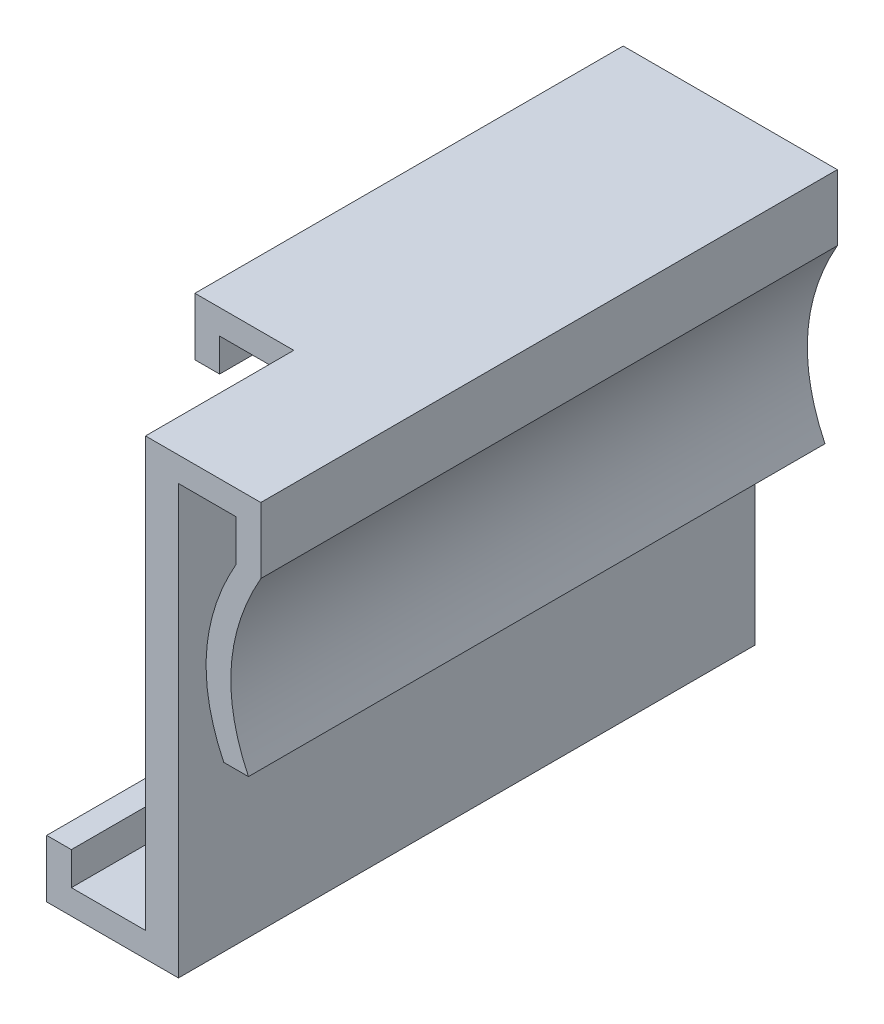
ISO-10303-21;
HEADER;
FILE_DESCRIPTION(('STEP AP214'),'2;1');
FILE_NAME('part.step','',(''),(''),'','','');
FILE_SCHEMA(('AUTOMOTIVE_DESIGN { 1 0 10303 214 1 1 1 1 }'));
ENDSEC;
DATA;
#1=APPLICATION_CONTEXT('core data for automotive mechanical design processes');
#2=APPLICATION_PROTOCOL_DEFINITION('international standard','automotive_design',2000,#1);
#3=PRODUCT_CONTEXT('',#1,'mechanical');
#4=PRODUCT('Part','Part','',(#3));
#5=PRODUCT_RELATED_PRODUCT_CATEGORY('part','',(#4));
#6=PRODUCT_DEFINITION_FORMATION('','',#4);
#7=PRODUCT_DEFINITION_CONTEXT('part definition',#1,'design');
#8=PRODUCT_DEFINITION('design','',#6,#7);
#9=PRODUCT_DEFINITION_SHAPE('','',#8);
#10=(LENGTH_UNIT() NAMED_UNIT(*) SI_UNIT(.MILLI.,.METRE.));
#11=(NAMED_UNIT(*) PLANE_ANGLE_UNIT() SI_UNIT($,.RADIAN.));
#12=(NAMED_UNIT(*) SI_UNIT($,.STERADIAN.) SOLID_ANGLE_UNIT());
#13=UNCERTAINTY_MEASURE_WITH_UNIT(LENGTH_MEASURE(1.E-05),#10,'distance_accuracy_value','');
#14=(GEOMETRIC_REPRESENTATION_CONTEXT(3) GLOBAL_UNCERTAINTY_ASSIGNED_CONTEXT((#13)) GLOBAL_UNIT_ASSIGNED_CONTEXT((#10,
#11,#12)) REPRESENTATION_CONTEXT('',''));
#15=CARTESIAN_POINT('',(0.,0.,0.));
#16=DIRECTION('',(0.,0.,1.));
#17=DIRECTION('',(1.,0.,0.));
#18=AXIS2_PLACEMENT_3D('',#15,#16,#17);
#19=CARTESIAN_POINT('',(-7.,0.,35.));
#20=DIRECTION('',(1.,0.,0.));
#21=DIRECTION('',(0.,0.,-1.));
#22=AXIS2_PLACEMENT_3D('',#19,#20,#21);
#23=PLANE('',#22);
#24=DIRECTION('',(0.,-1.,0.));
#25=VECTOR('',#24,1.);
#26=CARTESIAN_POINT('',(-7.,13.75,26.));
#27=LINE('',#26,#25);
#28=CARTESIAN_POINT('',(-7.,13.75,26.));
#29=VERTEX_POINT('',#28);
#30=CARTESIAN_POINT('',(-7.,10.25,26.));
#31=VERTEX_POINT('',#30);
#32=EDGE_CURVE('E251',#29,#31,#27,.T.);
#33=ORIENTED_EDGE('',*,*,#32,.F.);
#34=DIRECTION('',(0.,0.,-1.));
#35=VECTOR('',#34,1.);
#36=CARTESIAN_POINT('',(-7.,13.75,35.));
#37=LINE('',#36,#35);
#38=CARTESIAN_POINT('',(-7.,13.75,0.));
#39=VERTEX_POINT('',#38);
#40=EDGE_CURVE('E280',#29,#39,#37,.T.);
#41=ORIENTED_EDGE('',*,*,#40,.T.);
#42=DIRECTION('',(0.,-1.,0.));
#43=VECTOR('',#42,1.);
#44=CARTESIAN_POINT('',(-7.,0.,0.));
#45=LINE('',#44,#43);
#46=CARTESIAN_POINT('',(-7.,10.25,0.));
#47=VERTEX_POINT('',#46);
#48=EDGE_CURVE('E356',#39,#47,#45,.T.);
#49=ORIENTED_EDGE('',*,*,#48,.T.);
#50=DIRECTION('',(0.,0.,-1.));
#51=VECTOR('',#50,1.);
#52=CARTESIAN_POINT('',(-7.,10.25,35.));
#53=LINE('',#52,#51);
#54=EDGE_CURVE('E278',#31,#47,#53,.T.);
#55=ORIENTED_EDGE('',*,*,#54,.F.);
#56=EDGE_LOOP('',(#33,#41,#49,#55));
#57=FACE_BOUND('',#56,.T.);
#58=ADVANCED_FACE('F37',(#57),#23,.F.);
#59=CARTESIAN_POINT('',(0.,10.25,35.));
#60=DIRECTION('',(0.,1.,0.));
#61=DIRECTION('',(0.,0.,1.));
#62=AXIS2_PLACEMENT_3D('',#59,#60,#61);
#63=PLANE('',#62);
#64=DIRECTION('',(1.,0.,0.));
#65=VECTOR('',#64,1.);
#66=CARTESIAN_POINT('',(-7.,10.25,26.));
#67=LINE('',#66,#65);
#68=CARTESIAN_POINT('',(-5.5,10.25,26.));
#69=VERTEX_POINT('',#68);
#70=EDGE_CURVE('E248',#31,#69,#67,.T.);
#71=ORIENTED_EDGE('',*,*,#70,.F.);
#72=ORIENTED_EDGE('',*,*,#54,.T.);
#73=DIRECTION('',(1.,0.,0.));
#74=VECTOR('',#73,1.);
#75=CARTESIAN_POINT('',(0.,10.25,0.));
#76=LINE('',#75,#74);
#77=CARTESIAN_POINT('',(-5.5,10.25,0.));
#78=VERTEX_POINT('',#77);
#79=EDGE_CURVE('E359',#47,#78,#76,.T.);
#80=ORIENTED_EDGE('',*,*,#79,.T.);
#81=DIRECTION('',(0.,0.,-1.));
#82=VECTOR('',#81,1.);
#83=CARTESIAN_POINT('',(-5.5,10.25,35.));
#84=LINE('',#83,#82);
#85=EDGE_CURVE('E272',#69,#78,#84,.T.);
#86=ORIENTED_EDGE('',*,*,#85,.F.);
#87=EDGE_LOOP('',(#71,#72,#80,#86));
#88=FACE_BOUND('',#87,.T.);
#89=ADVANCED_FACE('F373',(#88),#63,.F.);
#90=CARTESIAN_POINT('',(-5.5,0.,35.));
#91=DIRECTION('',(1.,0.,0.));
#92=DIRECTION('',(0.,1.,0.));
#93=AXIS2_PLACEMENT_3D('',#90,#91,#92);
#94=PLANE('',#93);
#95=DIRECTION('',(0.,0.,-1.));
#96=VECTOR('',#95,1.);
#97=CARTESIAN_POINT('',(-5.5,12.25,35.));
#98=LINE('',#97,#96);
#99=CARTESIAN_POINT('',(-5.5,12.25,26.));
#100=VERTEX_POINT('',#99);
#101=CARTESIAN_POINT('',(-5.5,12.25,0.));
#102=VERTEX_POINT('',#101);
#103=EDGE_CURVE('E113',#100,#102,#98,.T.);
#104=ORIENTED_EDGE('',*,*,#103,.F.);
#105=DIRECTION('',(0.,1.,0.));
#106=VECTOR('',#105,1.);
#107=CARTESIAN_POINT('',(-5.5,10.25,26.));
#108=LINE('',#107,#106);
#109=EDGE_CURVE('E245',#69,#100,#108,.T.);
#110=ORIENTED_EDGE('',*,*,#109,.F.);
#111=ORIENTED_EDGE('',*,*,#85,.T.);
#112=DIRECTION('',(0.,-1.,0.));
#113=VECTOR('',#112,1.);
#114=CARTESIAN_POINT('',(-5.5,0.,0.));
#115=LINE('',#114,#113);
#116=EDGE_CURVE('E361',#102,#78,#115,.T.);
#117=ORIENTED_EDGE('',*,*,#116,.F.);
#118=EDGE_LOOP('',(#104,#110,#111,#117));
#119=FACE_BOUND('',#118,.T.);
#120=ADVANCED_FACE('F370',(#119),#94,.T.);
#121=CARTESIAN_POINT('',(0.,12.25,35.));
#122=DIRECTION('',(0.,-1.,0.));
#123=DIRECTION('',(0.,0.,-1.));
#124=AXIS2_PLACEMENT_3D('',#121,#122,#123);
#125=PLANE('',#124);
#126=DIRECTION('',(0.,0.,-1.));
#127=VECTOR('',#126,1.);
#128=CARTESIAN_POINT('',(-1.,12.25,35.));
#129=LINE('',#128,#127);
#130=CARTESIAN_POINT('',(-1.,12.25,26.));
#131=VERTEX_POINT('',#130);
#132=CARTESIAN_POINT('',(-1.,12.25,0.));
#133=VERTEX_POINT('',#132);
#134=EDGE_CURVE('E121',#131,#133,#129,.T.);
#135=ORIENTED_EDGE('',*,*,#134,.F.);
#136=DIRECTION('',(1.,0.,0.));
#137=VECTOR('',#136,1.);
#138=CARTESIAN_POINT('',(-5.5,12.25,26.));
#139=LINE('',#138,#137);
#140=EDGE_CURVE('E260',#100,#131,#139,.T.);
#141=ORIENTED_EDGE('',*,*,#140,.F.);
#142=ORIENTED_EDGE('',*,*,#103,.T.);
#143=DIRECTION('',(-1.,0.,0.));
#144=VECTOR('',#143,1.);
#145=CARTESIAN_POINT('',(0.,12.25,0.));
#146=LINE('',#145,#144);
#147=EDGE_CURVE('E240',#133,#102,#146,.T.);
#148=ORIENTED_EDGE('',*,*,#147,.F.);
#149=EDGE_LOOP('',(#135,#141,#142,#148));
#150=FACE_BOUND('',#149,.T.);
#151=ADVANCED_FACE('F269',(#150),#125,.T.);
#152=CARTESIAN_POINT('',(-1.,0.,35.));
#153=DIRECTION('',(-1.,0.,0.));
#154=DIRECTION('',(0.,0.,1.));
#155=AXIS2_PLACEMENT_3D('',#152,#153,#154);
#156=PLANE('',#155);
#157=DIRECTION('',(0.,1.,0.));
#158=VECTOR('',#157,1.);
#159=CARTESIAN_POINT('',(-1.,0.,0.));
#160=LINE('',#159,#158);
#161=CARTESIAN_POINT('',(-1.,-12.25,0.));
#162=VERTEX_POINT('',#161);
#163=EDGE_CURVE('E244',#162,#133,#160,.T.);
#164=ORIENTED_EDGE('',*,*,#163,.F.);
#165=DIRECTION('',(0.,0.,-1.));
#166=VECTOR('',#165,1.);
#167=CARTESIAN_POINT('',(-1.,-12.25,35.));
#168=LINE('',#167,#166);
#169=CARTESIAN_POINT('',(-1.,-12.25,35.));
#170=VERTEX_POINT('',#169);
#171=EDGE_CURVE('E11',#170,#162,#168,.T.);
#172=ORIENTED_EDGE('',*,*,#171,.F.);
#173=DIRECTION('',(0.,1.,0.));
#174=VECTOR('',#173,1.);
#175=CARTESIAN_POINT('',(-1.,0.,35.));
#176=LINE('',#175,#174);
#177=CARTESIAN_POINT('',(-1.,13.75,35.));
#178=VERTEX_POINT('',#177);
#179=EDGE_CURVE('E238',#170,#178,#176,.T.);
#180=ORIENTED_EDGE('',*,*,#179,.T.);
#181=DIRECTION('',(0.,0.,1.));
#182=VECTOR('',#181,1.);
#183=CARTESIAN_POINT('',(-1.,13.75,26.));
#184=LINE('',#183,#182);
#185=CARTESIAN_POINT('',(-1.,13.75,26.));
#186=VERTEX_POINT('',#185);
#187=EDGE_CURVE('E241',#186,#178,#184,.T.);
#188=ORIENTED_EDGE('',*,*,#187,.F.);
#189=DIRECTION('',(0.,1.,0.));
#190=VECTOR('',#189,1.);
#191=CARTESIAN_POINT('',(-1.,12.25,26.));
#192=LINE('',#191,#190);
#193=EDGE_CURVE('E257',#131,#186,#192,.T.);
#194=ORIENTED_EDGE('',*,*,#193,.F.);
#195=ORIENTED_EDGE('',*,*,#134,.T.);
#196=EDGE_LOOP('',(#164,#172,#180,#188,#194,#195));
#197=FACE_BOUND('',#196,.T.);
#198=ADVANCED_FACE('F39',(#197),#156,.T.);
#199=CARTESIAN_POINT('',(0.,-12.25,35.));
#200=DIRECTION('',(0.,-1.,0.));
#201=DIRECTION('',(0.,0.,-1.));
#202=AXIS2_PLACEMENT_3D('',#199,#200,#201);
#203=PLANE('',#202);
#204=DIRECTION('',(-1.,0.,0.));
#205=VECTOR('',#204,1.);
#206=CARTESIAN_POINT('',(0.,-12.25,0.));
#207=LINE('',#206,#205);
#208=CARTESIAN_POINT('',(-5.5,-12.25,0.));
#209=VERTEX_POINT('',#208);
#210=EDGE_CURVE('E315',#162,#209,#207,.T.);
#211=ORIENTED_EDGE('',*,*,#210,.T.);
#212=DIRECTION('',(0.,0.,-1.));
#213=VECTOR('',#212,1.);
#214=CARTESIAN_POINT('',(-5.5,-12.25,35.));
#215=LINE('',#214,#213);
#216=CARTESIAN_POINT('',(-5.5,-12.25,35.));
#217=VERTEX_POINT('',#216);
#218=EDGE_CURVE('E46',#217,#209,#215,.T.);
#219=ORIENTED_EDGE('',*,*,#218,.F.);
#220=DIRECTION('',(-1.,0.,0.));
#221=VECTOR('',#220,1.);
#222=CARTESIAN_POINT('',(0.,-12.25,35.));
#223=LINE('',#222,#221);
#224=EDGE_CURVE('E236',#170,#217,#223,.T.);
#225=ORIENTED_EDGE('',*,*,#224,.F.);
#226=ORIENTED_EDGE('',*,*,#171,.T.);
#227=EDGE_LOOP('',(#211,#219,#225,#226));
#228=FACE_BOUND('',#227,.T.);
#229=ADVANCED_FACE('F365',(#228),#203,.F.);
#230=CARTESIAN_POINT('',(-5.5,0.,35.));
#231=DIRECTION('',(-1.,0.,0.));
#232=DIRECTION('',(0.,0.,1.));
#233=AXIS2_PLACEMENT_3D('',#230,#231,#232);
#234=PLANE('',#233);
#235=DIRECTION('',(0.,1.,0.));
#236=VECTOR('',#235,1.);
#237=CARTESIAN_POINT('',(-5.5,0.,0.));
#238=LINE('',#237,#236);
#239=CARTESIAN_POINT('',(-5.5,-10.25,0.));
#240=VERTEX_POINT('',#239);
#241=EDGE_CURVE('E309',#209,#240,#238,.T.);
#242=ORIENTED_EDGE('',*,*,#241,.T.);
#243=DIRECTION('',(0.,0.,-1.));
#244=VECTOR('',#243,1.);
#245=CARTESIAN_POINT('',(-5.5,-10.25,35.));
#246=LINE('',#245,#244);
#247=CARTESIAN_POINT('',(-5.5,-10.25,35.));
#248=VERTEX_POINT('',#247);
#249=EDGE_CURVE('E300',#248,#240,#246,.T.);
#250=ORIENTED_EDGE('',*,*,#249,.F.);
#251=DIRECTION('',(0.,1.,0.));
#252=VECTOR('',#251,1.);
#253=CARTESIAN_POINT('',(-5.5,0.,35.));
#254=LINE('',#253,#252);
#255=EDGE_CURVE('E234',#217,#248,#254,.T.);
#256=ORIENTED_EDGE('',*,*,#255,.F.);
#257=ORIENTED_EDGE('',*,*,#218,.T.);
#258=EDGE_LOOP('',(#242,#250,#256,#257));
#259=FACE_BOUND('',#258,.T.);
#260=ADVANCED_FACE('F307',(#259),#234,.F.);
#261=CARTESIAN_POINT('',(0.,-10.25,35.));
#262=DIRECTION('',(0.,1.,0.));
#263=DIRECTION('',(0.,0.,1.));
#264=AXIS2_PLACEMENT_3D('',#261,#262,#263);
#265=PLANE('',#264);
#266=DIRECTION('',(1.,0.,0.));
#267=VECTOR('',#266,1.);
#268=CARTESIAN_POINT('',(0.,-10.25,0.));
#269=LINE('',#268,#267);
#270=CARTESIAN_POINT('',(-7.,-10.25,0.));
#271=VERTEX_POINT('',#270);
#272=EDGE_CURVE('E318',#271,#240,#269,.T.);
#273=ORIENTED_EDGE('',*,*,#272,.F.);
#274=DIRECTION('',(0.,0.,-1.));
#275=VECTOR('',#274,1.);
#276=CARTESIAN_POINT('',(-7.,-10.25,35.));
#277=LINE('',#276,#275);
#278=CARTESIAN_POINT('',(-7.,-10.25,35.));
#279=VERTEX_POINT('',#278);
#280=EDGE_CURVE('E298',#279,#271,#277,.T.);
#281=ORIENTED_EDGE('',*,*,#280,.F.);
#282=DIRECTION('',(1.,0.,0.));
#283=VECTOR('',#282,1.);
#284=CARTESIAN_POINT('',(0.,-10.25,35.));
#285=LINE('',#284,#283);
#286=EDGE_CURVE('E231',#279,#248,#285,.T.);
#287=ORIENTED_EDGE('',*,*,#286,.T.);
#288=ORIENTED_EDGE('',*,*,#249,.T.);
#289=EDGE_LOOP('',(#273,#281,#287,#288));
#290=FACE_BOUND('',#289,.T.);
#291=ADVANCED_FACE('F504',(#290),#265,.T.);
#292=CARTESIAN_POINT('',(-7.,0.,35.));
#293=DIRECTION('',(-1.,0.,0.));
#294=DIRECTION('',(0.,0.,1.));
#295=AXIS2_PLACEMENT_3D('',#292,#293,#294);
#296=PLANE('',#295);
#297=DIRECTION('',(0.,1.,0.));
#298=VECTOR('',#297,1.);
#299=CARTESIAN_POINT('',(-7.,0.,0.));
#300=LINE('',#299,#298);
#301=CARTESIAN_POINT('',(-7.,-13.75,0.));
#302=VERTEX_POINT('',#301);
#303=EDGE_CURVE('E320',#302,#271,#300,.T.);
#304=ORIENTED_EDGE('',*,*,#303,.F.);
#305=DIRECTION('',(0.,0.,-1.));
#306=VECTOR('',#305,1.);
#307=CARTESIAN_POINT('',(-7.,-13.75,35.));
#308=LINE('',#307,#306);
#309=CARTESIAN_POINT('',(-7.,-13.75,35.));
#310=VERTEX_POINT('',#309);
#311=EDGE_CURVE('E296',#310,#302,#308,.T.);
#312=ORIENTED_EDGE('',*,*,#311,.F.);
#313=DIRECTION('',(0.,1.,0.));
#314=VECTOR('',#313,1.);
#315=CARTESIAN_POINT('',(-7.,0.,35.));
#316=LINE('',#315,#314);
#317=EDGE_CURVE('E228',#310,#279,#316,.T.);
#318=ORIENTED_EDGE('',*,*,#317,.T.);
#319=ORIENTED_EDGE('',*,*,#280,.T.);
#320=EDGE_LOOP('',(#304,#312,#318,#319));
#321=FACE_BOUND('',#320,.T.);
#322=ADVANCED_FACE('F512',(#321),#296,.T.);
#323=CARTESIAN_POINT('',(0.,-13.75,35.));
#324=DIRECTION('',(0.,-1.,0.));
#325=DIRECTION('',(0.,0.,-1.));
#326=AXIS2_PLACEMENT_3D('',#323,#324,#325);
#327=PLANE('',#326);
#328=DIRECTION('',(-1.,0.,0.));
#329=VECTOR('',#328,1.);
#330=CARTESIAN_POINT('',(0.,-13.75,0.));
#331=LINE('',#330,#329);
#332=CARTESIAN_POINT('',(1.,-13.75,0.));
#333=VERTEX_POINT('',#332);
#334=EDGE_CURVE('E326',#333,#302,#331,.T.);
#335=ORIENTED_EDGE('',*,*,#334,.F.);
#336=DIRECTION('',(0.,0.,-1.));
#337=VECTOR('',#336,1.);
#338=CARTESIAN_POINT('',(1.,-13.75,35.));
#339=LINE('',#338,#337);
#340=CARTESIAN_POINT('',(1.,-13.75,35.));
#341=VERTEX_POINT('',#340);
#342=EDGE_CURVE('E294',#341,#333,#339,.T.);
#343=ORIENTED_EDGE('',*,*,#342,.F.);
#344=DIRECTION('',(-1.,0.,0.));
#345=VECTOR('',#344,1.);
#346=CARTESIAN_POINT('',(0.,-13.75,35.));
#347=LINE('',#346,#345);
#348=EDGE_CURVE('E225',#341,#310,#347,.T.);
#349=ORIENTED_EDGE('',*,*,#348,.T.);
#350=ORIENTED_EDGE('',*,*,#311,.T.);
#351=EDGE_LOOP('',(#335,#343,#349,#350));
#352=FACE_BOUND('',#351,.T.);
#353=ADVANCED_FACE('F521',(#352),#327,.T.);
#354=CARTESIAN_POINT('',(1.,0.,35.));
#355=DIRECTION('',(-1.,0.,0.));
#356=DIRECTION('',(0.,0.,1.));
#357=AXIS2_PLACEMENT_3D('',#354,#355,#356);
#358=PLANE('',#357);
#359=DIRECTION('',(0.,1.,0.));
#360=VECTOR('',#359,1.);
#361=CARTESIAN_POINT('',(1.,0.,0.));
#362=LINE('',#361,#360);
#363=CARTESIAN_POINT('',(1.,12.25,0.));
#364=VERTEX_POINT('',#363);
#365=EDGE_CURVE('E329',#333,#364,#362,.T.);
#366=ORIENTED_EDGE('',*,*,#365,.T.);
#367=DIRECTION('',(0.,0.,-1.));
#368=VECTOR('',#367,1.);
#369=CARTESIAN_POINT('',(1.,12.25,35.));
#370=LINE('',#369,#368);
#371=CARTESIAN_POINT('',(1.,12.25,35.));
#372=VERTEX_POINT('',#371);
#373=EDGE_CURVE('E291',#372,#364,#370,.T.);
#374=ORIENTED_EDGE('',*,*,#373,.F.);
#375=DIRECTION('',(0.,1.,0.));
#376=VECTOR('',#375,1.);
#377=CARTESIAN_POINT('',(1.,0.,35.));
#378=LINE('',#377,#376);
#379=EDGE_CURVE('E223',#341,#372,#378,.T.);
#380=ORIENTED_EDGE('',*,*,#379,.F.);
#381=ORIENTED_EDGE('',*,*,#342,.T.);
#382=EDGE_LOOP('',(#366,#374,#380,#381));
#383=FACE_BOUND('',#382,.T.);
#384=ADVANCED_FACE('F533',(#383),#358,.F.);
#385=CARTESIAN_POINT('',(0.,12.25,35.));
#386=DIRECTION('',(0.,1.,0.));
#387=DIRECTION('',(0.,0.,1.));
#388=AXIS2_PLACEMENT_3D('',#385,#386,#387);
#389=PLANE('',#388);
#390=DIRECTION('',(1.,0.,0.));
#391=VECTOR('',#390,1.);
#392=CARTESIAN_POINT('',(0.,12.25,0.));
#393=LINE('',#392,#391);
#394=CARTESIAN_POINT('',(4.5,12.25,0.));
#395=VERTEX_POINT('',#394);
#396=EDGE_CURVE('E331',#364,#395,#393,.T.);
#397=ORIENTED_EDGE('',*,*,#396,.T.);
#398=DIRECTION('',(0.,0.,-1.));
#399=VECTOR('',#398,1.);
#400=CARTESIAN_POINT('',(4.5,12.25,35.));
#401=LINE('',#400,#399);
#402=CARTESIAN_POINT('',(4.5,12.25,35.));
#403=VERTEX_POINT('',#402);
#404=EDGE_CURVE('E288',#403,#395,#401,.T.);
#405=ORIENTED_EDGE('',*,*,#404,.F.);
#406=DIRECTION('',(1.,0.,0.));
#407=VECTOR('',#406,1.);
#408=CARTESIAN_POINT('',(0.,12.25,35.));
#409=LINE('',#408,#407);
#410=EDGE_CURVE('E221',#372,#403,#409,.T.);
#411=ORIENTED_EDGE('',*,*,#410,.F.);
#412=ORIENTED_EDGE('',*,*,#373,.T.);
#413=EDGE_LOOP('',(#397,#405,#411,#412));
#414=FACE_BOUND('',#413,.T.);
#415=ADVANCED_FACE('F545',(#414),#389,.F.);
#416=CARTESIAN_POINT('',(4.5,0.,35.));
#417=DIRECTION('',(1.,0.,0.));
#418=DIRECTION('',(0.,0.,-1.));
#419=AXIS2_PLACEMENT_3D('',#416,#417,#418);
#420=PLANE('',#419);
#421=DIRECTION('',(0.,-1.,0.));
#422=VECTOR('',#421,1.);
#423=CARTESIAN_POINT('',(4.5,0.,0.));
#424=LINE('',#423,#422);
#425=CARTESIAN_POINT('',(4.5,9.74999999999999,0.));
#426=VERTEX_POINT('',#425);
#427=EDGE_CURVE('E333',#395,#426,#424,.T.);
#428=ORIENTED_EDGE('',*,*,#427,.T.);
#429=DIRECTION('',(0.,0.,-1.));
#430=VECTOR('',#429,1.);
#431=CARTESIAN_POINT('',(4.5,9.74999999999999,35.));
#432=LINE('',#431,#430);
#433=CARTESIAN_POINT('',(4.5,9.74999999999999,35.));
#434=VERTEX_POINT('',#433);
#435=EDGE_CURVE('E285',#434,#426,#432,.T.);
#436=ORIENTED_EDGE('',*,*,#435,.F.);
#437=DIRECTION('',(0.,-1.,0.));
#438=VECTOR('',#437,1.);
#439=CARTESIAN_POINT('',(4.5,0.,35.));
#440=LINE('',#439,#438);
#441=EDGE_CURVE('E216',#403,#434,#440,.T.);
#442=ORIENTED_EDGE('',*,*,#441,.F.);
#443=ORIENTED_EDGE('',*,*,#404,.T.);
#444=EDGE_LOOP('',(#428,#436,#442,#443));
#445=FACE_BOUND('',#444,.T.);
#446=ADVANCED_FACE('F209',(#445),#420,.F.);
#447=CARTESIAN_POINT('',(4.5,9.74999999999999,35.));
#448=CARTESIAN_POINT('',(1.28288548240467,4.09573573130876,35.));
#449=CARTESIAN_POINT('',(3.75000000000001,-1.03689729420487,35.));
#450=B_SPLINE_CURVE_WITH_KNOTS('',2,(#447,#448,#449),.UNSPECIFIED.,.F.,.F.,(3,3),(0.,1.),.UNSPECIFIED.);
#451=DIRECTION('',(0.,0.,-1.));
#452=VECTOR('',#451,1.);
#453=SURFACE_OF_LINEAR_EXTRUSION('',#450,#452);
#454=CARTESIAN_POINT('',(4.5,9.74999999999999,0.));
#455=CARTESIAN_POINT('',(1.28288548240467,4.09573573130876,0.));
#456=CARTESIAN_POINT('',(3.75000000000001,-1.03689729420487,0.));
#457=B_SPLINE_CURVE_WITH_KNOTS('',2,(#454,#455,#456),.UNSPECIFIED.,.F.,.F.,(3,3),(0.,1.),.UNSPECIFIED.);
#458=CARTESIAN_POINT('',(3.75000000000001,-1.03689729420487,0.));
#459=VERTEX_POINT('',#458);
#460=EDGE_CURVE('E335',#426,#459,#457,.T.);
#461=ORIENTED_EDGE('',*,*,#460,.T.);
#462=DIRECTION('',(0.,0.,-1.));
#463=VECTOR('',#462,1.);
#464=CARTESIAN_POINT('',(3.75000000000001,-1.03689729420487,35.));
#465=LINE('',#464,#463);
#466=CARTESIAN_POINT('',(3.75000000000001,-1.03689729420487,35.));
#467=VERTEX_POINT('',#466);
#468=EDGE_CURVE('E182',#467,#459,#465,.T.);
#469=ORIENTED_EDGE('',*,*,#468,.F.);
#470=EDGE_CURVE('E169',#434,#467,#450,.T.);
#471=ORIENTED_EDGE('',*,*,#470,.F.);
#472=ORIENTED_EDGE('',*,*,#435,.T.);
#473=EDGE_LOOP('',(#461,#469,#471,#472));
#474=FACE_BOUND('',#473,.T.);
#475=ADVANCED_FACE('F206',(#474),#453,.F.);
#476=CARTESIAN_POINT('',(0.,-1.03689729420487,35.));
#477=DIRECTION('',(0.,1.,0.));
#478=DIRECTION('',(0.,0.,1.));
#479=AXIS2_PLACEMENT_3D('',#476,#477,#478);
#480=PLANE('',#479);
#481=DIRECTION('',(1.,0.,0.));
#482=VECTOR('',#481,1.);
#483=CARTESIAN_POINT('',(0.,-1.03689729420487,0.));
#484=LINE('',#483,#482);
#485=CARTESIAN_POINT('',(5.25000000000001,-1.03689729420487,0.));
#486=VERTEX_POINT('',#485);
#487=EDGE_CURVE('E178',#459,#486,#484,.T.);
#488=ORIENTED_EDGE('',*,*,#487,.T.);
#489=DIRECTION('',(0.,0.,-1.));
#490=VECTOR('',#489,1.);
#491=CARTESIAN_POINT('',(5.25000000000001,-1.03689729420487,35.));
#492=LINE('',#491,#490);
#493=CARTESIAN_POINT('',(5.25000000000001,-1.03689729420487,35.));
#494=VERTEX_POINT('',#493);
#495=EDGE_CURVE('E175',#494,#486,#492,.T.);
#496=ORIENTED_EDGE('',*,*,#495,.F.);
#497=DIRECTION('',(1.,0.,0.));
#498=VECTOR('',#497,1.);
#499=CARTESIAN_POINT('',(0.,-1.03689729420487,35.));
#500=LINE('',#499,#498);
#501=EDGE_CURVE('E161',#467,#494,#500,.T.);
#502=ORIENTED_EDGE('',*,*,#501,.F.);
#503=ORIENTED_EDGE('',*,*,#468,.T.);
#504=EDGE_LOOP('',(#488,#496,#502,#503));
#505=FACE_BOUND('',#504,.T.);
#506=ADVANCED_FACE('F176',(#505),#480,.F.);
#507=CARTESIAN_POINT('',(6.,9.75,35.));
#508=CARTESIAN_POINT('',(2.78288548240467,4.09573573130877,35.));
#509=CARTESIAN_POINT('',(5.25000000000001,-1.03689729420487,35.));
#510=B_SPLINE_CURVE_WITH_KNOTS('',2,(#507,#508,#509),.UNSPECIFIED.,.F.,.F.,(3,3),(0.,1.),.UNSPECIFIED.);
#511=DIRECTION('',(0.,0.,-1.));
#512=VECTOR('',#511,1.);
#513=SURFACE_OF_LINEAR_EXTRUSION('',#510,#512);
#514=CARTESIAN_POINT('',(6.,9.75,0.));
#515=CARTESIAN_POINT('',(2.78288548240467,4.09573573130877,0.));
#516=CARTESIAN_POINT('',(5.25000000000001,-1.03689729420487,0.));
#517=B_SPLINE_CURVE_WITH_KNOTS('',2,(#514,#515,#516),.UNSPECIFIED.,.F.,.F.,(3,3),(0.,1.),.UNSPECIFIED.);
#518=CARTESIAN_POINT('',(6.,9.75,0.));
#519=VERTEX_POINT('',#518);
#520=EDGE_CURVE('E343',#519,#486,#517,.T.);
#521=ORIENTED_EDGE('',*,*,#520,.F.);
#522=DIRECTION('',(0.,0.,-1.));
#523=VECTOR('',#522,1.);
#524=CARTESIAN_POINT('',(6.,9.75,35.));
#525=LINE('',#524,#523);
#526=CARTESIAN_POINT('',(6.,9.75,35.));
#527=VERTEX_POINT('',#526);
#528=EDGE_CURVE('E183',#527,#519,#525,.T.);
#529=ORIENTED_EDGE('',*,*,#528,.F.);
#530=EDGE_CURVE('E167',#527,#494,#510,.T.);
#531=ORIENTED_EDGE('',*,*,#530,.T.);
#532=ORIENTED_EDGE('',*,*,#495,.T.);
#533=EDGE_LOOP('',(#521,#529,#531,#532));
#534=FACE_BOUND('',#533,.T.);
#535=ADVANCED_FACE('F185',(#534),#513,.T.);
#536=CARTESIAN_POINT('',(6.,0.,35.));
#537=DIRECTION('',(1.,0.,0.));
#538=DIRECTION('',(0.,0.,-1.));
#539=AXIS2_PLACEMENT_3D('',#536,#537,#538);
#540=PLANE('',#539);
#541=DIRECTION('',(0.,-1.,0.));
#542=VECTOR('',#541,1.);
#543=CARTESIAN_POINT('',(6.,0.,0.));
#544=LINE('',#543,#542);
#545=CARTESIAN_POINT('',(6.,13.75,0.));
#546=VERTEX_POINT('',#545);
#547=EDGE_CURVE('E347',#546,#519,#544,.T.);
#548=ORIENTED_EDGE('',*,*,#547,.F.);
#549=DIRECTION('',(0.,0.,-1.));
#550=VECTOR('',#549,1.);
#551=CARTESIAN_POINT('',(6.,13.75,35.));
#552=LINE('',#551,#550);
#553=CARTESIAN_POINT('',(6.,13.75,35.));
#554=VERTEX_POINT('',#553);
#555=EDGE_CURVE('E54',#554,#546,#552,.T.);
#556=ORIENTED_EDGE('',*,*,#555,.F.);
#557=DIRECTION('',(0.,-1.,0.));
#558=VECTOR('',#557,1.);
#559=CARTESIAN_POINT('',(6.,0.,35.));
#560=LINE('',#559,#558);
#561=EDGE_CURVE('E186',#554,#527,#560,.T.);
#562=ORIENTED_EDGE('',*,*,#561,.T.);
#563=ORIENTED_EDGE('',*,*,#528,.T.);
#564=EDGE_LOOP('',(#548,#556,#562,#563));
#565=FACE_BOUND('',#564,.T.);
#566=ADVANCED_FACE('F202',(#565),#540,.T.);
#567=CARTESIAN_POINT('',(0.,13.75,35.));
#568=DIRECTION('',(0.,-1.,0.));
#569=DIRECTION('',(0.,0.,-1.));
#570=AXIS2_PLACEMENT_3D('',#567,#568,#569);
#571=PLANE('',#570);
#572=DIRECTION('',(-1.,0.,0.));
#573=VECTOR('',#572,1.);
#574=CARTESIAN_POINT('',(-1.,13.75,26.));
#575=LINE('',#574,#573);
#576=EDGE_CURVE('E254',#186,#29,#575,.T.);
#577=ORIENTED_EDGE('',*,*,#576,.F.);
#578=ORIENTED_EDGE('',*,*,#187,.T.);
#579=DIRECTION('',(-1.,0.,0.));
#580=VECTOR('',#579,1.);
#581=CARTESIAN_POINT('',(0.,13.75,35.));
#582=LINE('',#581,#580);
#583=EDGE_CURVE('E188',#554,#178,#582,.T.);
#584=ORIENTED_EDGE('',*,*,#583,.F.);
#585=ORIENTED_EDGE('',*,*,#555,.T.);
#586=DIRECTION('',(-1.,0.,0.));
#587=VECTOR('',#586,1.);
#588=CARTESIAN_POINT('',(0.,13.75,0.));
#589=LINE('',#588,#587);
#590=EDGE_CURVE('E353',#546,#39,#589,.T.);
#591=ORIENTED_EDGE('',*,*,#590,.T.);
#592=ORIENTED_EDGE('',*,*,#40,.F.);
#593=EDGE_LOOP('',(#577,#578,#584,#585,#591,#592));
#594=FACE_BOUND('',#593,.T.);
#595=ADVANCED_FACE('F383',(#594),#571,.F.);
#596=CARTESIAN_POINT('',(0.,0.,35.));
#597=DIRECTION('',(0.,0.,1.));
#598=DIRECTION('',(1.,0.,0.));
#599=AXIS2_PLACEMENT_3D('',#596,#597,#598);
#600=PLANE('',#599);
#601=ORIENTED_EDGE('',*,*,#583,.T.);
#602=ORIENTED_EDGE('',*,*,#179,.F.);
#603=ORIENTED_EDGE('',*,*,#224,.T.);
#604=ORIENTED_EDGE('',*,*,#255,.T.);
#605=ORIENTED_EDGE('',*,*,#286,.F.);
#606=ORIENTED_EDGE('',*,*,#317,.F.);
#607=ORIENTED_EDGE('',*,*,#348,.F.);
#608=ORIENTED_EDGE('',*,*,#379,.T.);
#609=ORIENTED_EDGE('',*,*,#410,.T.);
#610=ORIENTED_EDGE('',*,*,#441,.T.);
#611=ORIENTED_EDGE('',*,*,#470,.T.);
#612=ORIENTED_EDGE('',*,*,#501,.T.);
#613=ORIENTED_EDGE('',*,*,#530,.F.);
#614=ORIENTED_EDGE('',*,*,#561,.F.);
#615=EDGE_LOOP('',(#601,#602,#603,#604,#605,#606,#607,#608,#609,#610,#611,#612,#613,#614));
#616=FACE_BOUND('',#615,.T.);
#617=ADVANCED_FACE('F164',(#616),#600,.T.);
#618=CARTESIAN_POINT('',(0.,0.,0.));
#619=DIRECTION('',(0.,0.,1.));
#620=DIRECTION('',(1.,0.,0.));
#621=AXIS2_PLACEMENT_3D('',#618,#619,#620);
#622=PLANE('',#621);
#623=ORIENTED_EDGE('',*,*,#163,.T.);
#624=ORIENTED_EDGE('',*,*,#147,.T.);
#625=ORIENTED_EDGE('',*,*,#116,.T.);
#626=ORIENTED_EDGE('',*,*,#79,.F.);
#627=ORIENTED_EDGE('',*,*,#48,.F.);
#628=ORIENTED_EDGE('',*,*,#590,.F.);
#629=ORIENTED_EDGE('',*,*,#547,.T.);
#630=ORIENTED_EDGE('',*,*,#520,.T.);
#631=ORIENTED_EDGE('',*,*,#487,.F.);
#632=ORIENTED_EDGE('',*,*,#460,.F.);
#633=ORIENTED_EDGE('',*,*,#427,.F.);
#634=ORIENTED_EDGE('',*,*,#396,.F.);
#635=ORIENTED_EDGE('',*,*,#365,.F.);
#636=ORIENTED_EDGE('',*,*,#334,.T.);
#637=ORIENTED_EDGE('',*,*,#303,.T.);
#638=ORIENTED_EDGE('',*,*,#272,.T.);
#639=ORIENTED_EDGE('',*,*,#241,.F.);
#640=ORIENTED_EDGE('',*,*,#210,.F.);
#641=EDGE_LOOP('',(#623,#624,#625,#626,#627,#628,#629,#630,#631,#632,#633,#634,#635,#636,#637,
#638,#639,#640));
#642=FACE_BOUND('',#641,.T.);
#643=ADVANCED_FACE('F314',(#642),#622,.F.);
#644=CARTESIAN_POINT('',(0.,0.,26.));
#645=DIRECTION('',(0.,0.,1.));
#646=DIRECTION('',(1.,0.,0.));
#647=AXIS2_PLACEMENT_3D('',#644,#645,#646);
#648=PLANE('',#647);
#649=ORIENTED_EDGE('',*,*,#140,.T.);
#650=ORIENTED_EDGE('',*,*,#193,.T.);
#651=ORIENTED_EDGE('',*,*,#576,.T.);
#652=ORIENTED_EDGE('',*,*,#32,.T.);
#653=ORIENTED_EDGE('',*,*,#70,.T.);
#654=ORIENTED_EDGE('',*,*,#109,.T.);
#655=EDGE_LOOP('',(#649,#650,#651,#652,#653,#654));
#656=FACE_BOUND('',#655,.T.);
#657=ADVANCED_FACE('F264',(#656),#648,.T.);
#658=CLOSED_SHELL('',(#58,#89,#120,#151,#198,#229,#260,#291,#322,#353,#384,#415,#446,#475,#506,
#535,#566,#595,#617,#643,#657));
#659=MANIFOLD_SOLID_BREP('B2',#658);
#660=ADVANCED_BREP_SHAPE_REPRESENTATION('',(#18,#659),#14);
#661=SHAPE_DEFINITION_REPRESENTATION(#9,#660);
ENDSEC;
END-ISO-10303-21;
